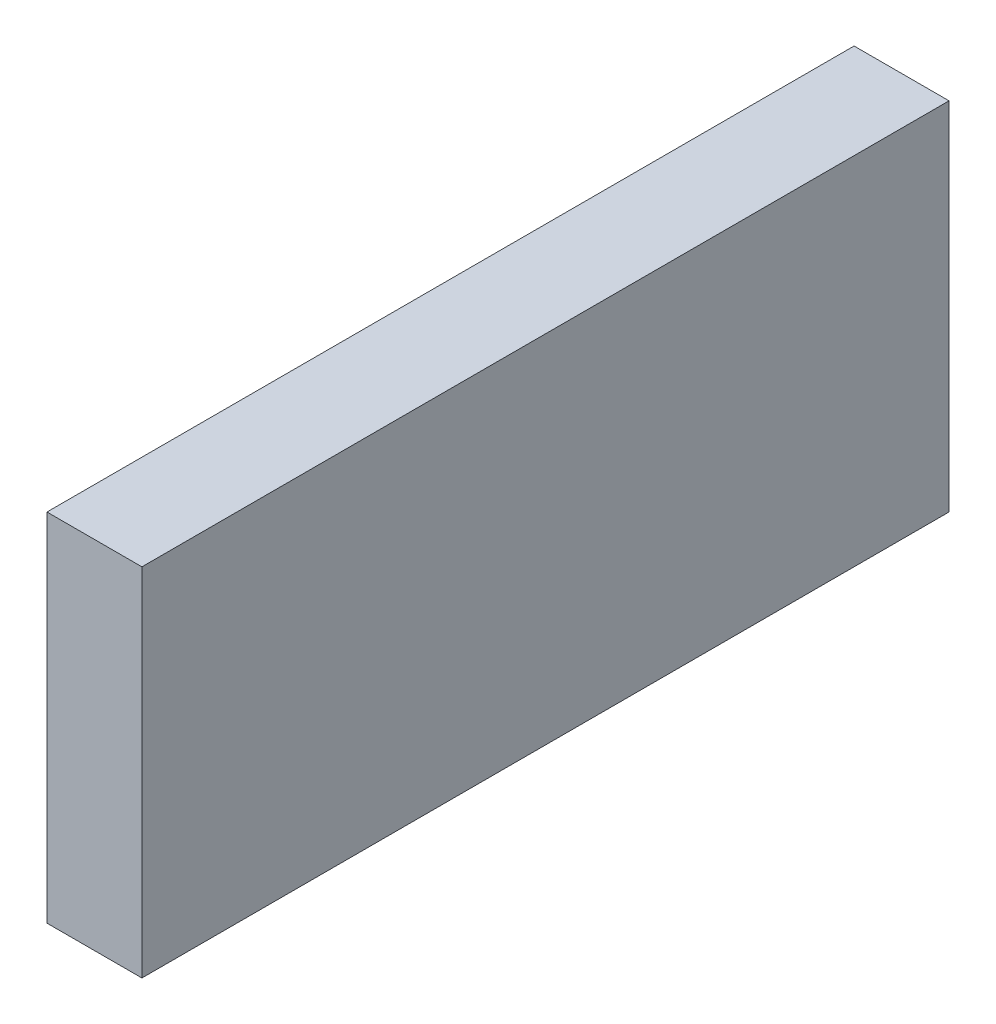
ISO-10303-21;
HEADER;
FILE_DESCRIPTION(('STEP AP214'),'2;1');
FILE_NAME('part.step','',(''),(''),'','','');
FILE_SCHEMA(('AUTOMOTIVE_DESIGN { 1 0 10303 214 1 1 1 1 }'));
ENDSEC;
DATA;
#1=APPLICATION_CONTEXT('core data for automotive mechanical design processes');
#2=APPLICATION_PROTOCOL_DEFINITION('international standard','automotive_design',2000,#1);
#3=PRODUCT_CONTEXT('',#1,'mechanical');
#4=PRODUCT('Part','Part','',(#3));
#5=PRODUCT_RELATED_PRODUCT_CATEGORY('part','',(#4));
#6=PRODUCT_DEFINITION_FORMATION('','',#4);
#7=PRODUCT_DEFINITION_CONTEXT('part definition',#1,'design');
#8=PRODUCT_DEFINITION('design','',#6,#7);
#9=PRODUCT_DEFINITION_SHAPE('','',#8);
#10=(LENGTH_UNIT() NAMED_UNIT(*) SI_UNIT(.MILLI.,.METRE.));
#11=(NAMED_UNIT(*) PLANE_ANGLE_UNIT() SI_UNIT($,.RADIAN.));
#12=(NAMED_UNIT(*) SI_UNIT($,.STERADIAN.) SOLID_ANGLE_UNIT());
#13=UNCERTAINTY_MEASURE_WITH_UNIT(LENGTH_MEASURE(1.E-05),#10,'distance_accuracy_value','');
#14=(GEOMETRIC_REPRESENTATION_CONTEXT(3) GLOBAL_UNCERTAINTY_ASSIGNED_CONTEXT((#13)) GLOBAL_UNIT_ASSIGNED_CONTEXT((#10,
#11,#12)) REPRESENTATION_CONTEXT('',''));
#15=CARTESIAN_POINT('',(0.,0.,0.));
#16=DIRECTION('',(0.,0.,1.));
#17=DIRECTION('',(1.,0.,0.));
#18=AXIS2_PLACEMENT_3D('',#15,#16,#17);
#19=CARTESIAN_POINT('',(-20.,150.,-170.));
#20=DIRECTION('',(1.,0.,0.));
#21=DIRECTION('',(0.,0.,-1.));
#22=AXIS2_PLACEMENT_3D('',#19,#20,#21);
#23=PLANE('',#22);
#24=DIRECTION('',(0.,0.,1.));
#25=VECTOR('',#24,1.);
#26=CARTESIAN_POINT('',(-20.,0.,-170.));
#27=LINE('',#26,#25);
#28=CARTESIAN_POINT('',(-20.,0.,-170.));
#29=VERTEX_POINT('',#28);
#30=CARTESIAN_POINT('',(-20.,0.,170.));
#31=VERTEX_POINT('',#30);
#32=EDGE_CURVE('E96',#29,#31,#27,.T.);
#33=ORIENTED_EDGE('',*,*,#32,.T.);
#34=DIRECTION('',(0.,-1.,0.));
#35=VECTOR('',#34,1.);
#36=CARTESIAN_POINT('',(-20.,150.,170.));
#37=LINE('',#36,#35);
#38=CARTESIAN_POINT('',(-20.,150.,170.));
#39=VERTEX_POINT('',#38);
#40=EDGE_CURVE('E11',#39,#31,#37,.T.);
#41=ORIENTED_EDGE('',*,*,#40,.F.);
#42=DIRECTION('',(0.,0.,1.));
#43=VECTOR('',#42,1.);
#44=CARTESIAN_POINT('',(-20.,150.,-170.));
#45=LINE('',#44,#43);
#46=CARTESIAN_POINT('',(-20.,150.,-170.));
#47=VERTEX_POINT('',#46);
#48=EDGE_CURVE('E84',#47,#39,#45,.T.);
#49=ORIENTED_EDGE('',*,*,#48,.F.);
#50=DIRECTION('',(0.,-1.,0.));
#51=VECTOR('',#50,1.);
#52=CARTESIAN_POINT('',(-20.,150.,-170.));
#53=LINE('',#52,#51);
#54=EDGE_CURVE('E92',#47,#29,#53,.T.);
#55=ORIENTED_EDGE('',*,*,#54,.T.);
#56=EDGE_LOOP('',(#33,#41,#49,#55));
#57=FACE_BOUND('',#56,.T.);
#58=ADVANCED_FACE('F33',(#57),#23,.F.);
#59=CARTESIAN_POINT('',(20.,150.,170.));
#60=DIRECTION('',(0.,0.,-1.));
#61=DIRECTION('',(-1.,0.,0.));
#62=AXIS2_PLACEMENT_3D('',#59,#60,#61);
#63=PLANE('',#62);
#64=DIRECTION('',(1.,0.,0.));
#65=VECTOR('',#64,1.);
#66=CARTESIAN_POINT('',(20.,0.,170.));
#67=LINE('',#66,#65);
#68=CARTESIAN_POINT('',(20.,0.,170.));
#69=VERTEX_POINT('',#68);
#70=EDGE_CURVE('E88',#31,#69,#67,.T.);
#71=ORIENTED_EDGE('',*,*,#70,.T.);
#72=DIRECTION('',(0.,-1.,0.));
#73=VECTOR('',#72,1.);
#74=CARTESIAN_POINT('',(20.,150.,170.));
#75=LINE('',#74,#73);
#76=CARTESIAN_POINT('',(20.,150.,170.));
#77=VERTEX_POINT('',#76);
#78=EDGE_CURVE('E41',#77,#69,#75,.T.);
#79=ORIENTED_EDGE('',*,*,#78,.F.);
#80=DIRECTION('',(1.,0.,0.));
#81=VECTOR('',#80,1.);
#82=CARTESIAN_POINT('',(20.,150.,170.));
#83=LINE('',#82,#81);
#84=EDGE_CURVE('E79',#39,#77,#83,.T.);
#85=ORIENTED_EDGE('',*,*,#84,.F.);
#86=ORIENTED_EDGE('',*,*,#40,.T.);
#87=EDGE_LOOP('',(#71,#79,#85,#86));
#88=FACE_BOUND('',#87,.T.);
#89=ADVANCED_FACE('F87',(#88),#63,.F.);
#90=CARTESIAN_POINT('',(20.,150.,-170.));
#91=DIRECTION('',(-1.,0.,0.));
#92=DIRECTION('',(0.,0.,1.));
#93=AXIS2_PLACEMENT_3D('',#90,#91,#92);
#94=PLANE('',#93);
#95=DIRECTION('',(0.,0.,-1.));
#96=VECTOR('',#95,1.);
#97=CARTESIAN_POINT('',(20.,0.,-170.));
#98=LINE('',#97,#96);
#99=CARTESIAN_POINT('',(20.,0.,-170.));
#100=VERTEX_POINT('',#99);
#101=EDGE_CURVE('E66',#69,#100,#98,.T.);
#102=ORIENTED_EDGE('',*,*,#101,.T.);
#103=DIRECTION('',(0.,-1.,0.));
#104=VECTOR('',#103,1.);
#105=CARTESIAN_POINT('',(20.,150.,-170.));
#106=LINE('',#105,#104);
#107=CARTESIAN_POINT('',(20.,150.,-170.));
#108=VERTEX_POINT('',#107);
#109=EDGE_CURVE('E89',#108,#100,#106,.T.);
#110=ORIENTED_EDGE('',*,*,#109,.F.);
#111=DIRECTION('',(0.,0.,-1.));
#112=VECTOR('',#111,1.);
#113=CARTESIAN_POINT('',(20.,150.,-170.));
#114=LINE('',#113,#112);
#115=EDGE_CURVE('E82',#77,#108,#114,.T.);
#116=ORIENTED_EDGE('',*,*,#115,.F.);
#117=ORIENTED_EDGE('',*,*,#78,.T.);
#118=EDGE_LOOP('',(#102,#110,#116,#117));
#119=FACE_BOUND('',#118,.T.);
#120=ADVANCED_FACE('F90',(#119),#94,.F.);
#121=CARTESIAN_POINT('',(20.,150.,-170.));
#122=DIRECTION('',(0.,0.,1.));
#123=DIRECTION('',(1.,0.,0.));
#124=AXIS2_PLACEMENT_3D('',#121,#122,#123);
#125=PLANE('',#124);
#126=DIRECTION('',(-1.,0.,0.));
#127=VECTOR('',#126,1.);
#128=CARTESIAN_POINT('',(20.,0.,-170.));
#129=LINE('',#128,#127);
#130=EDGE_CURVE('E72',#100,#29,#129,.T.);
#131=ORIENTED_EDGE('',*,*,#130,.T.);
#132=ORIENTED_EDGE('',*,*,#54,.F.);
#133=DIRECTION('',(-1.,0.,0.));
#134=VECTOR('',#133,1.);
#135=CARTESIAN_POINT('',(20.,150.,-170.));
#136=LINE('',#135,#134);
#137=EDGE_CURVE('E49',#108,#47,#136,.T.);
#138=ORIENTED_EDGE('',*,*,#137,.F.);
#139=ORIENTED_EDGE('',*,*,#109,.T.);
#140=EDGE_LOOP('',(#131,#132,#138,#139));
#141=FACE_BOUND('',#140,.T.);
#142=ADVANCED_FACE('F103',(#141),#125,.F.);
#143=CARTESIAN_POINT('',(0.,150.,0.));
#144=DIRECTION('',(0.,-1.,0.));
#145=DIRECTION('',(0.,0.,-1.));
#146=AXIS2_PLACEMENT_3D('',#143,#144,#145);
#147=PLANE('',#146);
#148=ORIENTED_EDGE('',*,*,#48,.T.);
#149=ORIENTED_EDGE('',*,*,#84,.T.);
#150=ORIENTED_EDGE('',*,*,#115,.T.);
#151=ORIENTED_EDGE('',*,*,#137,.T.);
#152=EDGE_LOOP('',(#148,#149,#150,#151));
#153=FACE_BOUND('',#152,.T.);
#154=ADVANCED_FACE('F80',(#153),#147,.F.);
#155=CARTESIAN_POINT('',(0.,0.,0.));
#156=DIRECTION('',(0.,-1.,0.));
#157=DIRECTION('',(0.,0.,-1.));
#158=AXIS2_PLACEMENT_3D('',#155,#156,#157);
#159=PLANE('',#158);
#160=ORIENTED_EDGE('',*,*,#32,.F.);
#161=ORIENTED_EDGE('',*,*,#130,.F.);
#162=ORIENTED_EDGE('',*,*,#101,.F.);
#163=ORIENTED_EDGE('',*,*,#70,.F.);
#164=EDGE_LOOP('',(#160,#161,#162,#163));
#165=FACE_BOUND('',#164,.T.);
#166=ADVANCED_FACE('F106',(#165),#159,.T.);
#167=CLOSED_SHELL('',(#58,#89,#120,#142,#154,#166));
#168=MANIFOLD_SOLID_BREP('B2',#167);
#169=ADVANCED_BREP_SHAPE_REPRESENTATION('',(#18,#168),#14);
#170=SHAPE_DEFINITION_REPRESENTATION(#9,#169);
ENDSEC;
END-ISO-10303-21;
